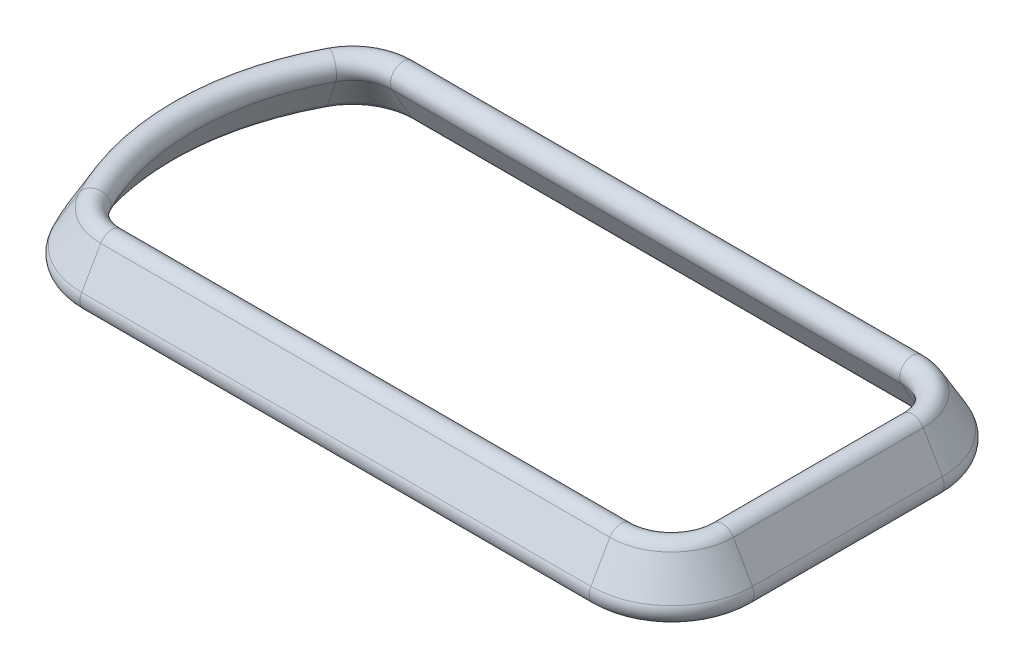
ISO-10303-21;
HEADER;
FILE_DESCRIPTION(('STEP AP214'),'2;1');
FILE_NAME('part.step','',(''),(''),'','','');
FILE_SCHEMA(('AUTOMOTIVE_DESIGN { 1 0 10303 214 1 1 1 1 }'));
ENDSEC;
DATA;
#1=APPLICATION_CONTEXT('core data for automotive mechanical design processes');
#2=APPLICATION_PROTOCOL_DEFINITION('international standard','automotive_design',2000,#1);
#3=PRODUCT_CONTEXT('',#1,'mechanical');
#4=PRODUCT('Part','Part','',(#3));
#5=PRODUCT_RELATED_PRODUCT_CATEGORY('part','',(#4));
#6=PRODUCT_DEFINITION_FORMATION('','',#4);
#7=PRODUCT_DEFINITION_CONTEXT('part definition',#1,'design');
#8=PRODUCT_DEFINITION('design','',#6,#7);
#9=PRODUCT_DEFINITION_SHAPE('','',#8);
#10=(LENGTH_UNIT() NAMED_UNIT(*) SI_UNIT(.MILLI.,.METRE.));
#11=(NAMED_UNIT(*) PLANE_ANGLE_UNIT() SI_UNIT($,.RADIAN.));
#12=(NAMED_UNIT(*) SI_UNIT($,.STERADIAN.) SOLID_ANGLE_UNIT());
#13=UNCERTAINTY_MEASURE_WITH_UNIT(LENGTH_MEASURE(1.E-05),#10,'distance_accuracy_value','');
#14=(GEOMETRIC_REPRESENTATION_CONTEXT(3) GLOBAL_UNCERTAINTY_ASSIGNED_CONTEXT((#13)) GLOBAL_UNIT_ASSIGNED_CONTEXT((#10,
#11,#12)) REPRESENTATION_CONTEXT('',''));
#15=CARTESIAN_POINT('',(0.,0.,0.));
#16=DIRECTION('',(0.,0.,1.));
#17=DIRECTION('',(1.,0.,0.));
#18=AXIS2_PLACEMENT_3D('',#15,#16,#17);
#19=CARTESIAN_POINT('',(-100.351041830044,2.50000000000002,-37.4328113574438));
#20=DIRECTION('',(0.,-1.,0.));
#21=DIRECTION('',(0.,0.,-1.));
#22=AXIS2_PLACEMENT_3D('',#19,#20,#21);
#23=CONICAL_SURFACE('',#22,24.3301270189222,0.523598775598298);
#24=DIRECTION('',(0.,-0.866025403784437,-0.500000000000002));
#25=VECTOR('',#24,1.);
#26=CARTESIAN_POINT('',(-100.351041830044,2.50000000000002,-61.762938376366));
#27=LINE('',#26,#25);
#28=CARTESIAN_POINT('',(-100.351041830044,2.50000000000002,-61.762938376366));
#29=VERTEX_POINT('',#28);
#30=CARTESIAN_POINT('',(-100.351041830044,-10.4903810567666,-69.262938376366));
#31=VERTEX_POINT('',#30);
#32=EDGE_CURVE('E308',#29,#31,#27,.T.);
#33=ORIENTED_EDGE('',*,*,#32,.T.);
#34=CARTESIAN_POINT('',(-100.351041830044,-10.4903810567666,-37.4328113574438));
#35=DIRECTION('',(0.,1.,0.));
#36=DIRECTION('',(0.,0.,1.));
#37=AXIS2_PLACEMENT_3D('',#34,#35,#36);
#38=CIRCLE('',#37,31.8301270189221);
#39=CARTESIAN_POINT('',(-128.481745622582,-10.4903810567666,-52.3264506097287));
#40=VERTEX_POINT('',#39);
#41=EDGE_CURVE('E45',#31,#40,#38,.T.);
#42=ORIENTED_EDGE('',*,*,#41,.T.);
#43=DIRECTION('',(-0.441888022875549,-0.866025403784437,-0.233955070984025));
#44=VECTOR('',#43,1.);
#45=CARTESIAN_POINT('',(-121.853425279449,2.50000000000002,-48.8171245449683));
#46=LINE('',#45,#44);
#47=CARTESIAN_POINT('',(-121.853425279449,2.50000000000002,-48.8171245449683));
#48=VERTEX_POINT('',#47);
#49=EDGE_CURVE('E332',#48,#40,#46,.T.);
#50=ORIENTED_EDGE('',*,*,#49,.F.);
#51=CARTESIAN_POINT('',(-100.351041830044,2.50000000000002,-37.4328113574438));
#52=DIRECTION('',(0.,1.,0.));
#53=DIRECTION('',(0.,0.,1.));
#54=AXIS2_PLACEMENT_3D('',#51,#52,#53);
#55=CIRCLE('',#54,24.3301270189222);
#56=EDGE_CURVE('E11',#29,#48,#55,.T.);
#57=ORIENTED_EDGE('',*,*,#56,.F.);
#58=EDGE_LOOP('',(#33,#42,#50,#57));
#59=FACE_BOUND('',#58,.T.);
#60=ADVANCED_FACE('F37',(#59),#23,.T.);
#61=CARTESIAN_POINT('',(-100.351041830044,-12.9903810567666,-37.4328113574438));
#62=DIRECTION('',(0.,1.,0.));
#63=DIRECTION('',(0.,0.,1.));
#64=AXIS2_PLACEMENT_3D('',#61,#62,#63);
#65=TOROIDAL_SURFACE('',#64,27.5,4.99999999999997);
#66=CARTESIAN_POINT('',(-100.351041830044,-12.9903810567666,-64.9328113574438));
#67=DIRECTION('',(-1.,0.,0.));
#68=DIRECTION('',(0.,0.,1.));
#69=AXIS2_PLACEMENT_3D('',#66,#67,#68);
#70=CIRCLE('',#69,4.99999999999997);
#71=CARTESIAN_POINT('',(-100.351041830044,-15.4903810567666,-60.6026843385217));
#72=VERTEX_POINT('',#71);
#73=EDGE_CURVE('E305',#31,#72,#70,.T.);
#74=ORIENTED_EDGE('',*,*,#73,.T.);
#75=CARTESIAN_POINT('',(-100.351041830044,-15.4903810567666,-37.4328113574438));
#76=DIRECTION('',(0.,1.,0.));
#77=DIRECTION('',(0.,0.,1.));
#78=AXIS2_PLACEMENT_3D('',#75,#76,#77);
#79=CIRCLE('',#78,23.1698729810779);
#80=CARTESIAN_POINT('',(-120.828020553816,-15.4903810567666,-48.2742299134016));
#81=VERTEX_POINT('',#80);
#82=EDGE_CURVE('E337',#72,#81,#79,.T.);
#83=ORIENTED_EDGE('',*,*,#82,.T.);
#84=CARTESIAN_POINT('',(-124.654883088199,-12.9903810567666,-50.3003402615651));
#85=DIRECTION('',(-0.467910141968048,0.,0.883776045751095));
#86=DIRECTION('',(0.883776045751095,0.,0.467910141968048));
#87=AXIS2_PLACEMENT_3D('',#84,#85,#86);
#88=CIRCLE('',#87,4.99999999999997);
#89=EDGE_CURVE('E330',#40,#81,#88,.T.);
#90=ORIENTED_EDGE('',*,*,#89,.F.);
#91=ORIENTED_EDGE('',*,*,#41,.F.);
#92=EDGE_LOOP('',(#74,#83,#90,#91));
#93=FACE_BOUND('',#92,.T.);
#94=ADVANCED_FACE('F361',(#93),#65,.T.);
#95=CARTESIAN_POINT('',(-100.351041830044,-15.4903810567666,-37.4328113574438));
#96=DIRECTION('',(0.,-1.,0.));
#97=DIRECTION('',(0.,0.,-1.));
#98=AXIS2_PLACEMENT_3D('',#95,#96,#97);
#99=CONICAL_SURFACE('',#98,23.1698729810779,0.523598775598306);
#100=DIRECTION('',(0.,0.866025403784435,0.500000000000006));
#101=VECTOR('',#100,1.);
#102=CARTESIAN_POINT('',(-100.351041830044,-2.50000000000003,-53.1026843385216));
#103=LINE('',#102,#101);
#104=CARTESIAN_POINT('',(-100.351041830044,-2.50000000000003,-53.1026843385216));
#105=VERTEX_POINT('',#104);
#106=EDGE_CURVE('E302',#72,#105,#103,.T.);
#107=ORIENTED_EDGE('',*,*,#106,.T.);
#108=CARTESIAN_POINT('',(-100.351041830044,-2.50000000000003,-37.4328113574438));
#109=DIRECTION('',(0.,1.,0.));
#110=DIRECTION('',(0.,0.,1.));
#111=AXIS2_PLACEMENT_3D('',#108,#109,#110);
#112=CIRCLE('',#111,15.6698729810778);
#113=CARTESIAN_POINT('',(-114.199700210683,-2.50000000000003,-44.7649038486412));
#114=VERTEX_POINT('',#113);
#115=EDGE_CURVE('E334',#105,#114,#112,.T.);
#116=ORIENTED_EDGE('',*,*,#115,.T.);
#117=DIRECTION('',(0.441888022875553,0.866025403784435,0.233955070984027));
#118=VECTOR('',#117,1.);
#119=CARTESIAN_POINT('',(-114.199700210683,-2.50000000000003,-44.7649038486412));
#120=LINE('',#119,#118);
#121=EDGE_CURVE('E327',#81,#114,#120,.T.);
#122=ORIENTED_EDGE('',*,*,#121,.F.);
#123=ORIENTED_EDGE('',*,*,#82,.F.);
#124=EDGE_LOOP('',(#107,#116,#122,#123));
#125=FACE_BOUND('',#124,.T.);
#126=ADVANCED_FACE('F360',(#125),#99,.F.);
#127=CARTESIAN_POINT('',(-100.351041830044,0.,-37.4328113574438));
#128=DIRECTION('',(0.,1.,0.));
#129=DIRECTION('',(0.,0.,1.));
#130=AXIS2_PLACEMENT_3D('',#127,#128,#129);
#131=TOROIDAL_SURFACE('',#130,20.,5.00000000000001);
#132=CARTESIAN_POINT('',(-100.351041830044,0.,-57.4328113574438));
#133=DIRECTION('',(-1.,0.,0.));
#134=DIRECTION('',(0.,0.,1.));
#135=AXIS2_PLACEMENT_3D('',#132,#133,#134);
#136=CIRCLE('',#135,5.00000000000001);
#137=EDGE_CURVE('E299',#105,#29,#136,.T.);
#138=ORIENTED_EDGE('',*,*,#137,.T.);
#139=ORIENTED_EDGE('',*,*,#56,.T.);
#140=CARTESIAN_POINT('',(-118.026562745066,0.,-46.7910141968047));
#141=DIRECTION('',(-0.467910141968048,0.,0.883776045751095));
#142=DIRECTION('',(0.883776045751095,0.,0.467910141968048));
#143=AXIS2_PLACEMENT_3D('',#140,#141,#142);
#144=CIRCLE('',#143,5.00000000000001);
#145=EDGE_CURVE('E177',#114,#48,#144,.T.);
#146=ORIENTED_EDGE('',*,*,#145,.F.);
#147=ORIENTED_EDGE('',*,*,#115,.F.);
#148=EDGE_LOOP('',(#138,#139,#146,#147));
#149=FACE_BOUND('',#148,.T.);
#150=ADVANCED_FACE('F484',(#149),#131,.T.);
#151=CARTESIAN_POINT('',(100.351041830044,2.50000000000002,-61.762938376366));
#152=DIRECTION('',(0.,0.500000000000002,-0.866025403784437));
#153=DIRECTION('',(0.,0.866025403784438,0.500000000000002));
#154=AXIS2_PLACEMENT_3D('',#151,#152,#153);
#155=PLANE('',#154);
#156=DIRECTION('',(0.,-0.866025403784437,-0.500000000000002));
#157=VECTOR('',#156,1.);
#158=CARTESIAN_POINT('',(100.351041830044,2.50000000000002,-61.762938376366));
#159=LINE('',#158,#157);
#160=CARTESIAN_POINT('',(100.351041830044,2.50000000000002,-61.762938376366));
#161=VERTEX_POINT('',#160);
#162=CARTESIAN_POINT('',(100.351041830044,-10.4903810567666,-69.262938376366));
#163=VERTEX_POINT('',#162);
#164=EDGE_CURVE('E284',#161,#163,#159,.T.);
#165=ORIENTED_EDGE('',*,*,#164,.T.);
#166=DIRECTION('',(-1.,0.,0.));
#167=VECTOR('',#166,1.);
#168=CARTESIAN_POINT('',(100.351041830044,-10.4903810567666,-69.262938376366));
#169=LINE('',#168,#167);
#170=EDGE_CURVE('E319',#163,#31,#169,.T.);
#171=ORIENTED_EDGE('',*,*,#170,.T.);
#172=ORIENTED_EDGE('',*,*,#32,.F.);
#173=DIRECTION('',(-1.,0.,0.));
#174=VECTOR('',#173,1.);
#175=CARTESIAN_POINT('',(100.351041830044,2.50000000000002,-61.762938376366));
#176=LINE('',#175,#174);
#177=EDGE_CURVE('E323',#161,#29,#176,.T.);
#178=ORIENTED_EDGE('',*,*,#177,.F.);
#179=EDGE_LOOP('',(#165,#171,#172,#178));
#180=FACE_BOUND('',#179,.T.);
#181=ADVANCED_FACE('F419',(#180),#155,.T.);
#182=CARTESIAN_POINT('',(100.351041830044,-12.9903810567666,-64.9328113574438));
#183=DIRECTION('',(-1.,0.,0.));
#184=DIRECTION('',(0.,0.,1.));
#185=AXIS2_PLACEMENT_3D('',#182,#183,#184);
#186=CYLINDRICAL_SURFACE('',#185,4.99999999999997);
#187=CARTESIAN_POINT('',(100.351041830044,-12.9903810567666,-64.9328113574438));
#188=DIRECTION('',(-1.,0.,0.));
#189=DIRECTION('',(0.,0.,1.));
#190=AXIS2_PLACEMENT_3D('',#187,#188,#189);
#191=CIRCLE('',#190,4.99999999999997);
#192=CARTESIAN_POINT('',(100.351041830044,-15.4903810567666,-60.6026843385217));
#193=VERTEX_POINT('',#192);
#194=EDGE_CURVE('E281',#163,#193,#191,.T.);
#195=ORIENTED_EDGE('',*,*,#194,.T.);
#196=DIRECTION('',(-1.,0.,0.));
#197=VECTOR('',#196,1.);
#198=CARTESIAN_POINT('',(100.351041830044,-15.4903810567666,-60.6026843385217));
#199=LINE('',#198,#197);
#200=EDGE_CURVE('E315',#193,#72,#199,.T.);
#201=ORIENTED_EDGE('',*,*,#200,.T.);
#202=ORIENTED_EDGE('',*,*,#73,.F.);
#203=ORIENTED_EDGE('',*,*,#170,.F.);
#204=EDGE_LOOP('',(#195,#201,#202,#203));
#205=FACE_BOUND('',#204,.T.);
#206=ADVANCED_FACE('F368',(#205),#186,.T.);
#207=CARTESIAN_POINT('',(100.351041830044,-2.50000000000003,-53.1026843385216));
#208=DIRECTION('',(0.,-0.500000000000006,0.866025403784435));
#209=DIRECTION('',(0.,-0.866025403784435,-0.500000000000006));
#210=AXIS2_PLACEMENT_3D('',#207,#208,#209);
#211=PLANE('',#210);
#212=DIRECTION('',(0.,0.866025403784435,0.500000000000006));
#213=VECTOR('',#212,1.);
#214=CARTESIAN_POINT('',(100.351041830044,-2.50000000000003,-53.1026843385216));
#215=LINE('',#214,#213);
#216=CARTESIAN_POINT('',(100.351041830044,-2.50000000000003,-53.1026843385216));
#217=VERTEX_POINT('',#216);
#218=EDGE_CURVE('E278',#193,#217,#215,.T.);
#219=ORIENTED_EDGE('',*,*,#218,.T.);
#220=DIRECTION('',(-1.,0.,0.));
#221=VECTOR('',#220,1.);
#222=CARTESIAN_POINT('',(100.351041830044,-2.50000000000003,-53.1026843385216));
#223=LINE('',#222,#221);
#224=EDGE_CURVE('E311',#217,#105,#223,.T.);
#225=ORIENTED_EDGE('',*,*,#224,.T.);
#226=ORIENTED_EDGE('',*,*,#106,.F.);
#227=ORIENTED_EDGE('',*,*,#200,.F.);
#228=EDGE_LOOP('',(#219,#225,#226,#227));
#229=FACE_BOUND('',#228,.T.);
#230=ADVANCED_FACE('F366',(#229),#211,.T.);
#231=CARTESIAN_POINT('',(100.351041830044,0.,-57.4328113574438));
#232=DIRECTION('',(-1.,0.,0.));
#233=DIRECTION('',(0.,0.,1.));
#234=AXIS2_PLACEMENT_3D('',#231,#232,#233);
#235=CYLINDRICAL_SURFACE('',#234,5.00000000000001);
#236=CARTESIAN_POINT('',(100.351041830044,0.,-57.4328113574438));
#237=DIRECTION('',(-1.,0.,0.));
#238=DIRECTION('',(0.,0.,1.));
#239=AXIS2_PLACEMENT_3D('',#236,#237,#238);
#240=CIRCLE('',#239,5.00000000000001);
#241=EDGE_CURVE('E275',#217,#161,#240,.T.);
#242=ORIENTED_EDGE('',*,*,#241,.T.);
#243=ORIENTED_EDGE('',*,*,#177,.T.);
#244=ORIENTED_EDGE('',*,*,#137,.F.);
#245=ORIENTED_EDGE('',*,*,#224,.F.);
#246=EDGE_LOOP('',(#242,#243,#244,#245));
#247=FACE_BOUND('',#246,.T.);
#248=ADVANCED_FACE('F421',(#247),#235,.T.);
#249=CARTESIAN_POINT('',(100.351041830044,2.50000000000002,-37.4328113574438));
#250=DIRECTION('',(0.,-1.,0.));
#251=DIRECTION('',(0.,0.,-1.));
#252=AXIS2_PLACEMENT_3D('',#249,#250,#251);
#253=CONICAL_SURFACE('',#252,24.3301270189222,0.523598775598299);
#254=DIRECTION('',(0.500000000000002,-0.866025403784437,0.));
#255=VECTOR('',#254,1.);
#256=CARTESIAN_POINT('',(124.681168848966,2.50000000000002,-37.4328113574438));
#257=LINE('',#256,#255);
#258=CARTESIAN_POINT('',(124.681168848966,2.50000000000002,-37.4328113574438));
#259=VERTEX_POINT('',#258);
#260=CARTESIAN_POINT('',(132.181168848966,-10.4903810567666,-37.4328113574438));
#261=VERTEX_POINT('',#260);
#262=EDGE_CURVE('E260',#259,#261,#257,.T.);
#263=ORIENTED_EDGE('',*,*,#262,.T.);
#264=CARTESIAN_POINT('',(100.351041830044,-10.4903810567666,-37.4328113574438));
#265=DIRECTION('',(0.,1.,0.));
#266=DIRECTION('',(0.,0.,1.));
#267=AXIS2_PLACEMENT_3D('',#264,#265,#266);
#268=CIRCLE('',#267,31.8301270189222);
#269=EDGE_CURVE('E293',#261,#163,#268,.T.);
#270=ORIENTED_EDGE('',*,*,#269,.T.);
#271=ORIENTED_EDGE('',*,*,#164,.F.);
#272=CARTESIAN_POINT('',(100.351041830044,2.50000000000002,-37.4328113574438));
#273=DIRECTION('',(0.,1.,0.));
#274=DIRECTION('',(0.,0.,1.));
#275=AXIS2_PLACEMENT_3D('',#272,#273,#274);
#276=CIRCLE('',#275,24.3301270189222);
#277=EDGE_CURVE('E296',#259,#161,#276,.T.);
#278=ORIENTED_EDGE('',*,*,#277,.F.);
#279=EDGE_LOOP('',(#263,#270,#271,#278));
#280=FACE_BOUND('',#279,.T.);
#281=ADVANCED_FACE('F425',(#280),#253,.T.);
#282=CARTESIAN_POINT('',(100.351041830044,-12.9903810567666,-37.4328113574438));
#283=DIRECTION('',(0.,1.,0.));
#284=DIRECTION('',(0.,0.,1.));
#285=AXIS2_PLACEMENT_3D('',#282,#283,#284);
#286=TOROIDAL_SURFACE('',#285,27.5,4.99999999999997);
#287=CARTESIAN_POINT('',(127.851041830044,-12.9903810567666,-37.4328113574438));
#288=DIRECTION('',(0.,0.,-1.));
#289=DIRECTION('',(-1.,0.,0.));
#290=AXIS2_PLACEMENT_3D('',#287,#288,#289);
#291=CIRCLE('',#290,4.99999999999997);
#292=CARTESIAN_POINT('',(123.520914811122,-15.4903810567666,-37.4328113574438));
#293=VERTEX_POINT('',#292);
#294=EDGE_CURVE('E257',#261,#293,#291,.T.);
#295=ORIENTED_EDGE('',*,*,#294,.T.);
#296=CARTESIAN_POINT('',(100.351041830044,-15.4903810567666,-37.4328113574438));
#297=DIRECTION('',(0.,1.,0.));
#298=DIRECTION('',(0.,0.,1.));
#299=AXIS2_PLACEMENT_3D('',#296,#297,#298);
#300=CIRCLE('',#299,23.1698729810779);
#301=EDGE_CURVE('E290',#293,#193,#300,.T.);
#302=ORIENTED_EDGE('',*,*,#301,.T.);
#303=ORIENTED_EDGE('',*,*,#194,.F.);
#304=ORIENTED_EDGE('',*,*,#269,.F.);
#305=EDGE_LOOP('',(#295,#302,#303,#304));
#306=FACE_BOUND('',#305,.T.);
#307=ADVANCED_FACE('F375',(#306),#286,.T.);
#308=CARTESIAN_POINT('',(100.351041830044,-15.4903810567666,-37.4328113574438));
#309=DIRECTION('',(0.,-1.,0.));
#310=DIRECTION('',(0.,0.,-1.));
#311=AXIS2_PLACEMENT_3D('',#308,#309,#310);
#312=CONICAL_SURFACE('',#311,23.1698729810779,0.523598775598306);
#313=DIRECTION('',(-0.500000000000006,0.866025403784435,0.));
#314=VECTOR('',#313,1.);
#315=CARTESIAN_POINT('',(116.020914811122,-2.50000000000003,-37.4328113574438));
#316=LINE('',#315,#314);
#317=CARTESIAN_POINT('',(116.020914811122,-2.50000000000003,-37.4328113574438));
#318=VERTEX_POINT('',#317);
#319=EDGE_CURVE('E254',#293,#318,#316,.T.);
#320=ORIENTED_EDGE('',*,*,#319,.T.);
#321=CARTESIAN_POINT('',(100.351041830044,-2.50000000000003,-37.4328113574438));
#322=DIRECTION('',(0.,1.,0.));
#323=DIRECTION('',(0.,0.,1.));
#324=AXIS2_PLACEMENT_3D('',#321,#322,#323);
#325=CIRCLE('',#324,15.6698729810778);
#326=EDGE_CURVE('E287',#318,#217,#325,.T.);
#327=ORIENTED_EDGE('',*,*,#326,.T.);
#328=ORIENTED_EDGE('',*,*,#218,.F.);
#329=ORIENTED_EDGE('',*,*,#301,.F.);
#330=EDGE_LOOP('',(#320,#327,#328,#329));
#331=FACE_BOUND('',#330,.T.);
#332=ADVANCED_FACE('F373',(#331),#312,.F.);
#333=CARTESIAN_POINT('',(100.351041830044,0.,-37.4328113574438));
#334=DIRECTION('',(0.,1.,0.));
#335=DIRECTION('',(0.,0.,1.));
#336=AXIS2_PLACEMENT_3D('',#333,#334,#335);
#337=TOROIDAL_SURFACE('',#336,20.,5.00000000000001);
#338=CARTESIAN_POINT('',(120.351041830044,0.,-37.4328113574438));
#339=DIRECTION('',(0.,0.,-1.));
#340=DIRECTION('',(-1.,0.,0.));
#341=AXIS2_PLACEMENT_3D('',#338,#339,#340);
#342=CIRCLE('',#341,5.00000000000001);
#343=EDGE_CURVE('E251',#318,#259,#342,.T.);
#344=ORIENTED_EDGE('',*,*,#343,.T.);
#345=ORIENTED_EDGE('',*,*,#277,.T.);
#346=ORIENTED_EDGE('',*,*,#241,.F.);
#347=ORIENTED_EDGE('',*,*,#326,.F.);
#348=EDGE_LOOP('',(#344,#345,#346,#347));
#349=FACE_BOUND('',#348,.T.);
#350=ADVANCED_FACE('F426',(#349),#337,.T.);
#351=CARTESIAN_POINT('',(124.681168848966,2.50000000000002,37.4328113574438));
#352=DIRECTION('',(0.866025403784437,0.500000000000002,0.));
#353=DIRECTION('',(-0.500000000000002,0.866025403784438,0.));
#354=AXIS2_PLACEMENT_3D('',#351,#352,#353);
#355=PLANE('',#354);
#356=DIRECTION('',(0.500000000000002,-0.866025403784437,0.));
#357=VECTOR('',#356,1.);
#358=CARTESIAN_POINT('',(124.681168848966,2.50000000000002,37.4328113574438));
#359=LINE('',#358,#357);
#360=CARTESIAN_POINT('',(124.681168848966,2.50000000000002,37.4328113574438));
#361=VERTEX_POINT('',#360);
#362=CARTESIAN_POINT('',(132.181168848966,-10.4903810567666,37.4328113574438));
#363=VERTEX_POINT('',#362);
#364=EDGE_CURVE('E236',#361,#363,#359,.T.);
#365=ORIENTED_EDGE('',*,*,#364,.T.);
#366=DIRECTION('',(0.,0.,-1.));
#367=VECTOR('',#366,1.);
#368=CARTESIAN_POINT('',(132.181168848966,-10.4903810567666,37.4328113574438));
#369=LINE('',#368,#367);
#370=EDGE_CURVE('E269',#363,#261,#369,.T.);
#371=ORIENTED_EDGE('',*,*,#370,.T.);
#372=ORIENTED_EDGE('',*,*,#262,.F.);
#373=DIRECTION('',(0.,0.,-1.));
#374=VECTOR('',#373,1.);
#375=CARTESIAN_POINT('',(124.681168848966,2.50000000000002,37.4328113574438));
#376=LINE('',#375,#374);
#377=EDGE_CURVE('E272',#361,#259,#376,.T.);
#378=ORIENTED_EDGE('',*,*,#377,.F.);
#379=EDGE_LOOP('',(#365,#371,#372,#378));
#380=FACE_BOUND('',#379,.T.);
#381=ADVANCED_FACE('F430',(#380),#355,.T.);
#382=CARTESIAN_POINT('',(127.851041830044,-12.9903810567666,37.4328113574438));
#383=DIRECTION('',(0.,0.,-1.));
#384=DIRECTION('',(-1.,0.,0.));
#385=AXIS2_PLACEMENT_3D('',#382,#383,#384);
#386=CYLINDRICAL_SURFACE('',#385,4.99999999999997);
#387=CARTESIAN_POINT('',(127.851041830044,-12.9903810567666,37.4328113574438));
#388=DIRECTION('',(0.,0.,-1.));
#389=DIRECTION('',(-1.,0.,0.));
#390=AXIS2_PLACEMENT_3D('',#387,#388,#389);
#391=CIRCLE('',#390,4.99999999999997);
#392=CARTESIAN_POINT('',(123.520914811122,-15.4903810567666,37.4328113574438));
#393=VERTEX_POINT('',#392);
#394=EDGE_CURVE('E233',#363,#393,#391,.T.);
#395=ORIENTED_EDGE('',*,*,#394,.T.);
#396=DIRECTION('',(0.,0.,-1.));
#397=VECTOR('',#396,1.);
#398=CARTESIAN_POINT('',(123.520914811122,-15.4903810567666,37.4328113574438));
#399=LINE('',#398,#397);
#400=EDGE_CURVE('E266',#393,#293,#399,.T.);
#401=ORIENTED_EDGE('',*,*,#400,.T.);
#402=ORIENTED_EDGE('',*,*,#294,.F.);
#403=ORIENTED_EDGE('',*,*,#370,.F.);
#404=EDGE_LOOP('',(#395,#401,#402,#403));
#405=FACE_BOUND('',#404,.T.);
#406=ADVANCED_FACE('F382',(#405),#386,.T.);
#407=CARTESIAN_POINT('',(116.020914811122,-2.50000000000003,37.4328113574438));
#408=DIRECTION('',(-0.866025403784435,-0.500000000000006,0.));
#409=DIRECTION('',(0.500000000000006,-0.866025403784435,0.));
#410=AXIS2_PLACEMENT_3D('',#407,#408,#409);
#411=PLANE('',#410);
#412=DIRECTION('',(-0.500000000000006,0.866025403784435,0.));
#413=VECTOR('',#412,1.);
#414=CARTESIAN_POINT('',(116.020914811122,-2.50000000000003,37.4328113574438));
#415=LINE('',#414,#413);
#416=CARTESIAN_POINT('',(116.020914811122,-2.50000000000003,37.4328113574438));
#417=VERTEX_POINT('',#416);
#418=EDGE_CURVE('E230',#393,#417,#415,.T.);
#419=ORIENTED_EDGE('',*,*,#418,.T.);
#420=DIRECTION('',(0.,0.,-1.));
#421=VECTOR('',#420,1.);
#422=CARTESIAN_POINT('',(116.020914811122,-2.50000000000003,37.4328113574438));
#423=LINE('',#422,#421);
#424=EDGE_CURVE('E263',#417,#318,#423,.T.);
#425=ORIENTED_EDGE('',*,*,#424,.T.);
#426=ORIENTED_EDGE('',*,*,#319,.F.);
#427=ORIENTED_EDGE('',*,*,#400,.F.);
#428=EDGE_LOOP('',(#419,#425,#426,#427));
#429=FACE_BOUND('',#428,.T.);
#430=ADVANCED_FACE('F380',(#429),#411,.T.);
#431=CARTESIAN_POINT('',(120.351041830044,0.,37.4328113574438));
#432=DIRECTION('',(0.,0.,-1.));
#433=DIRECTION('',(-1.,0.,0.));
#434=AXIS2_PLACEMENT_3D('',#431,#432,#433);
#435=CYLINDRICAL_SURFACE('',#434,5.00000000000001);
#436=CARTESIAN_POINT('',(120.351041830044,0.,37.4328113574438));
#437=DIRECTION('',(0.,0.,-1.));
#438=DIRECTION('',(-1.,0.,0.));
#439=AXIS2_PLACEMENT_3D('',#436,#437,#438);
#440=CIRCLE('',#439,5.00000000000001);
#441=EDGE_CURVE('E227',#417,#361,#440,.T.);
#442=ORIENTED_EDGE('',*,*,#441,.T.);
#443=ORIENTED_EDGE('',*,*,#377,.T.);
#444=ORIENTED_EDGE('',*,*,#343,.F.);
#445=ORIENTED_EDGE('',*,*,#424,.F.);
#446=EDGE_LOOP('',(#442,#443,#444,#445));
#447=FACE_BOUND('',#446,.T.);
#448=ADVANCED_FACE('F431',(#447),#435,.T.);
#449=CARTESIAN_POINT('',(100.351041830044,2.50000000000002,37.4328113574438));
#450=DIRECTION('',(0.,-1.,0.));
#451=DIRECTION('',(0.,0.,-1.));
#452=AXIS2_PLACEMENT_3D('',#449,#450,#451);
#453=CONICAL_SURFACE('',#452,24.3301270189222,0.523598775598299);
#454=DIRECTION('',(0.,-0.866025403784437,0.500000000000002));
#455=VECTOR('',#454,1.);
#456=CARTESIAN_POINT('',(100.351041830044,2.50000000000002,61.762938376366));
#457=LINE('',#456,#455);
#458=CARTESIAN_POINT('',(100.351041830044,2.50000000000002,61.762938376366));
#459=VERTEX_POINT('',#458);
#460=CARTESIAN_POINT('',(100.351041830044,-10.4903810567666,69.262938376366));
#461=VERTEX_POINT('',#460);
#462=EDGE_CURVE('E212',#459,#461,#457,.T.);
#463=ORIENTED_EDGE('',*,*,#462,.T.);
#464=CARTESIAN_POINT('',(100.351041830044,-10.4903810567666,37.4328113574438));
#465=DIRECTION('',(0.,1.,0.));
#466=DIRECTION('',(0.,0.,1.));
#467=AXIS2_PLACEMENT_3D('',#464,#465,#466);
#468=CIRCLE('',#467,31.8301270189222);
#469=EDGE_CURVE('E245',#461,#363,#468,.T.);
#470=ORIENTED_EDGE('',*,*,#469,.T.);
#471=ORIENTED_EDGE('',*,*,#364,.F.);
#472=CARTESIAN_POINT('',(100.351041830044,2.50000000000002,37.4328113574438));
#473=DIRECTION('',(0.,1.,0.));
#474=DIRECTION('',(0.,0.,1.));
#475=AXIS2_PLACEMENT_3D('',#472,#473,#474);
#476=CIRCLE('',#475,24.3301270189222);
#477=EDGE_CURVE('E248',#459,#361,#476,.T.);
#478=ORIENTED_EDGE('',*,*,#477,.F.);
#479=EDGE_LOOP('',(#463,#470,#471,#478));
#480=FACE_BOUND('',#479,.T.);
#481=ADVANCED_FACE('F435',(#480),#453,.T.);
#482=CARTESIAN_POINT('',(100.351041830044,-12.9903810567666,37.4328113574438));
#483=DIRECTION('',(0.,1.,0.));
#484=DIRECTION('',(0.,0.,1.));
#485=AXIS2_PLACEMENT_3D('',#482,#483,#484);
#486=TOROIDAL_SURFACE('',#485,27.5,4.99999999999997);
#487=CARTESIAN_POINT('',(100.351041830044,-12.9903810567666,64.9328113574439));
#488=DIRECTION('',(1.,0.,0.));
#489=DIRECTION('',(0.,0.,-1.));
#490=AXIS2_PLACEMENT_3D('',#487,#488,#489);
#491=CIRCLE('',#490,4.99999999999997);
#492=CARTESIAN_POINT('',(100.351041830044,-15.4903810567666,60.6026843385217));
#493=VERTEX_POINT('',#492);
#494=EDGE_CURVE('E209',#461,#493,#491,.T.);
#495=ORIENTED_EDGE('',*,*,#494,.T.);
#496=CARTESIAN_POINT('',(100.351041830044,-15.4903810567666,37.4328113574438));
#497=DIRECTION('',(0.,1.,0.));
#498=DIRECTION('',(0.,0.,1.));
#499=AXIS2_PLACEMENT_3D('',#496,#497,#498);
#500=CIRCLE('',#499,23.1698729810779);
#501=EDGE_CURVE('E242',#493,#393,#500,.T.);
#502=ORIENTED_EDGE('',*,*,#501,.T.);
#503=ORIENTED_EDGE('',*,*,#394,.F.);
#504=ORIENTED_EDGE('',*,*,#469,.F.);
#505=EDGE_LOOP('',(#495,#502,#503,#504));
#506=FACE_BOUND('',#505,.T.);
#507=ADVANCED_FACE('F389',(#506),#486,.T.);
#508=CARTESIAN_POINT('',(100.351041830044,-15.4903810567666,37.4328113574438));
#509=DIRECTION('',(0.,-1.,0.));
#510=DIRECTION('',(0.,0.,-1.));
#511=AXIS2_PLACEMENT_3D('',#508,#509,#510);
#512=CONICAL_SURFACE('',#511,23.1698729810779,0.523598775598306);
#513=DIRECTION('',(0.,0.866025403784435,-0.500000000000006));
#514=VECTOR('',#513,1.);
#515=CARTESIAN_POINT('',(100.351041830044,-2.50000000000003,53.1026843385216));
#516=LINE('',#515,#514);
#517=CARTESIAN_POINT('',(100.351041830044,-2.50000000000003,53.1026843385216));
#518=VERTEX_POINT('',#517);
#519=EDGE_CURVE('E206',#493,#518,#516,.T.);
#520=ORIENTED_EDGE('',*,*,#519,.T.);
#521=CARTESIAN_POINT('',(100.351041830044,-2.50000000000003,37.4328113574438));
#522=DIRECTION('',(0.,1.,0.));
#523=DIRECTION('',(0.,0.,1.));
#524=AXIS2_PLACEMENT_3D('',#521,#522,#523);
#525=CIRCLE('',#524,15.6698729810778);
#526=EDGE_CURVE('E239',#518,#417,#525,.T.);
#527=ORIENTED_EDGE('',*,*,#526,.T.);
#528=ORIENTED_EDGE('',*,*,#418,.F.);
#529=ORIENTED_EDGE('',*,*,#501,.F.);
#530=EDGE_LOOP('',(#520,#527,#528,#529));
#531=FACE_BOUND('',#530,.T.);
#532=ADVANCED_FACE('F387',(#531),#512,.F.);
#533=CARTESIAN_POINT('',(100.351041830044,0.,37.4328113574438));
#534=DIRECTION('',(0.,1.,0.));
#535=DIRECTION('',(0.,0.,1.));
#536=AXIS2_PLACEMENT_3D('',#533,#534,#535);
#537=TOROIDAL_SURFACE('',#536,20.,5.00000000000001);
#538=CARTESIAN_POINT('',(100.351041830044,0.,57.4328113574438));
#539=DIRECTION('',(1.,0.,0.));
#540=DIRECTION('',(0.,0.,-1.));
#541=AXIS2_PLACEMENT_3D('',#538,#539,#540);
#542=CIRCLE('',#541,5.00000000000001);
#543=EDGE_CURVE('E164',#518,#459,#542,.T.);
#544=ORIENTED_EDGE('',*,*,#543,.T.);
#545=ORIENTED_EDGE('',*,*,#477,.T.);
#546=ORIENTED_EDGE('',*,*,#441,.F.);
#547=ORIENTED_EDGE('',*,*,#526,.F.);
#548=EDGE_LOOP('',(#544,#545,#546,#547));
#549=FACE_BOUND('',#548,.T.);
#550=ADVANCED_FACE('F436',(#549),#537,.T.);
#551=CARTESIAN_POINT('',(-100.351041830044,2.50000000000002,61.762938376366));
#552=DIRECTION('',(0.,0.500000000000002,0.866025403784437));
#553=DIRECTION('',(0.,-0.866025403784438,0.500000000000002));
#554=AXIS2_PLACEMENT_3D('',#551,#552,#553);
#555=PLANE('',#554);
#556=DIRECTION('',(0.,-0.866025403784437,0.500000000000002));
#557=VECTOR('',#556,1.);
#558=CARTESIAN_POINT('',(-100.351041830044,2.50000000000002,61.762938376366));
#559=LINE('',#558,#557);
#560=CARTESIAN_POINT('',(-100.351041830044,2.50000000000002,61.762938376366));
#561=VERTEX_POINT('',#560);
#562=CARTESIAN_POINT('',(-100.351041830044,-10.4903810567666,69.262938376366));
#563=VERTEX_POINT('',#562);
#564=EDGE_CURVE('E161',#561,#563,#559,.T.);
#565=ORIENTED_EDGE('',*,*,#564,.T.);
#566=DIRECTION('',(1.,0.,0.));
#567=VECTOR('',#566,1.);
#568=CARTESIAN_POINT('',(-100.351041830044,-10.4903810567666,69.262938376366));
#569=LINE('',#568,#567);
#570=EDGE_CURVE('E221',#563,#461,#569,.T.);
#571=ORIENTED_EDGE('',*,*,#570,.T.);
#572=ORIENTED_EDGE('',*,*,#462,.F.);
#573=DIRECTION('',(1.,0.,0.));
#574=VECTOR('',#573,1.);
#575=CARTESIAN_POINT('',(-100.351041830044,2.50000000000002,61.762938376366));
#576=LINE('',#575,#574);
#577=EDGE_CURVE('E224',#561,#459,#576,.T.);
#578=ORIENTED_EDGE('',*,*,#577,.F.);
#579=EDGE_LOOP('',(#565,#571,#572,#578));
#580=FACE_BOUND('',#579,.T.);
#581=ADVANCED_FACE('F440',(#580),#555,.T.);
#582=CARTESIAN_POINT('',(-100.351041830044,-12.9903810567666,64.9328113574438));
#583=DIRECTION('',(1.,0.,0.));
#584=DIRECTION('',(0.,0.,-1.));
#585=AXIS2_PLACEMENT_3D('',#582,#583,#584);
#586=CYLINDRICAL_SURFACE('',#585,4.99999999999997);
#587=CARTESIAN_POINT('',(-100.351041830044,-12.9903810567666,64.9328113574438));
#588=DIRECTION('',(1.,0.,0.));
#589=DIRECTION('',(0.,0.,-1.));
#590=AXIS2_PLACEMENT_3D('',#587,#588,#589);
#591=CIRCLE('',#590,4.99999999999997);
#592=CARTESIAN_POINT('',(-100.351041830044,-15.4903810567666,60.6026843385217));
#593=VERTEX_POINT('',#592);
#594=EDGE_CURVE('E195',#563,#593,#591,.T.);
#595=ORIENTED_EDGE('',*,*,#594,.T.);
#596=DIRECTION('',(1.,0.,0.));
#597=VECTOR('',#596,1.);
#598=CARTESIAN_POINT('',(-100.351041830044,-15.4903810567666,60.6026843385217));
#599=LINE('',#598,#597);
#600=EDGE_CURVE('E218',#593,#493,#599,.T.);
#601=ORIENTED_EDGE('',*,*,#600,.T.);
#602=ORIENTED_EDGE('',*,*,#494,.F.);
#603=ORIENTED_EDGE('',*,*,#570,.F.);
#604=EDGE_LOOP('',(#595,#601,#602,#603));
#605=FACE_BOUND('',#604,.T.);
#606=ADVANCED_FACE('F396',(#605),#586,.T.);
#607=CARTESIAN_POINT('',(-100.351041830044,-2.50000000000003,53.1026843385216));
#608=DIRECTION('',(0.,-0.500000000000006,-0.866025403784435));
#609=DIRECTION('',(0.,0.866025403784435,-0.500000000000006));
#610=AXIS2_PLACEMENT_3D('',#607,#608,#609);
#611=PLANE('',#610);
#612=DIRECTION('',(0.,0.866025403784435,-0.500000000000006));
#613=VECTOR('',#612,1.);
#614=CARTESIAN_POINT('',(-100.351041830044,-2.50000000000003,53.1026843385216));
#615=LINE('',#614,#613);
#616=CARTESIAN_POINT('',(-100.351041830044,-2.50000000000003,53.1026843385216));
#617=VERTEX_POINT('',#616);
#618=EDGE_CURVE('E192',#593,#617,#615,.T.);
#619=ORIENTED_EDGE('',*,*,#618,.T.);
#620=DIRECTION('',(1.,0.,0.));
#621=VECTOR('',#620,1.);
#622=CARTESIAN_POINT('',(-100.351041830044,-2.50000000000003,53.1026843385216));
#623=LINE('',#622,#621);
#624=EDGE_CURVE('E215',#617,#518,#623,.T.);
#625=ORIENTED_EDGE('',*,*,#624,.T.);
#626=ORIENTED_EDGE('',*,*,#519,.F.);
#627=ORIENTED_EDGE('',*,*,#600,.F.);
#628=EDGE_LOOP('',(#619,#625,#626,#627));
#629=FACE_BOUND('',#628,.T.);
#630=ADVANCED_FACE('F394',(#629),#611,.T.);
#631=CARTESIAN_POINT('',(-100.351041830044,0.,57.4328113574438));
#632=DIRECTION('',(1.,0.,0.));
#633=DIRECTION('',(0.,0.,-1.));
#634=AXIS2_PLACEMENT_3D('',#631,#632,#633);
#635=CYLINDRICAL_SURFACE('',#634,5.00000000000001);
#636=CARTESIAN_POINT('',(-100.351041830044,0.,57.4328113574438));
#637=DIRECTION('',(1.,0.,0.));
#638=DIRECTION('',(0.,0.,-1.));
#639=AXIS2_PLACEMENT_3D('',#636,#637,#638);
#640=CIRCLE('',#639,5.00000000000001);
#641=EDGE_CURVE('E179',#617,#561,#640,.T.);
#642=ORIENTED_EDGE('',*,*,#641,.T.);
#643=ORIENTED_EDGE('',*,*,#577,.T.);
#644=ORIENTED_EDGE('',*,*,#543,.F.);
#645=ORIENTED_EDGE('',*,*,#624,.F.);
#646=EDGE_LOOP('',(#642,#643,#644,#645));
#647=FACE_BOUND('',#646,.T.);
#648=ADVANCED_FACE('F410',(#647),#635,.T.);
#649=CARTESIAN_POINT('',(-100.351041830044,2.50000000000002,37.4328113574438));
#650=DIRECTION('',(0.,-1.,0.));
#651=DIRECTION('',(0.,0.,-1.));
#652=AXIS2_PLACEMENT_3D('',#649,#650,#651);
#653=CONICAL_SURFACE('',#652,24.3301270189222,0.5235987755983);
#654=DIRECTION('',(-0.441888022875549,-0.866025403784437,0.233955070984025));
#655=VECTOR('',#654,1.);
#656=CARTESIAN_POINT('',(-121.853425279449,2.50000000000002,48.8171245449683));
#657=LINE('',#656,#655);
#658=CARTESIAN_POINT('',(-121.853425279449,2.50000000000002,48.8171245449683));
#659=VERTEX_POINT('',#658);
#660=CARTESIAN_POINT('',(-128.481745622582,-10.4903810567666,52.3264506097287));
#661=VERTEX_POINT('',#660);
#662=EDGE_CURVE('E159',#659,#661,#657,.T.);
#663=ORIENTED_EDGE('',*,*,#662,.T.);
#664=CARTESIAN_POINT('',(-100.351041830044,-10.4903810567666,37.4328113574438));
#665=DIRECTION('',(0.,1.,0.));
#666=DIRECTION('',(0.,0.,1.));
#667=AXIS2_PLACEMENT_3D('',#664,#665,#666);
#668=CIRCLE('',#667,31.8301270189222);
#669=EDGE_CURVE('E165',#661,#563,#668,.T.);
#670=ORIENTED_EDGE('',*,*,#669,.T.);
#671=ORIENTED_EDGE('',*,*,#564,.F.);
#672=CARTESIAN_POINT('',(-100.351041830044,2.50000000000002,37.4328113574438));
#673=DIRECTION('',(0.,1.,0.));
#674=DIRECTION('',(0.,0.,1.));
#675=AXIS2_PLACEMENT_3D('',#672,#673,#674);
#676=CIRCLE('',#675,24.3301270189222);
#677=EDGE_CURVE('E155',#659,#561,#676,.T.);
#678=ORIENTED_EDGE('',*,*,#677,.F.);
#679=EDGE_LOOP('',(#663,#670,#671,#678));
#680=FACE_BOUND('',#679,.T.);
#681=ADVANCED_FACE('F157',(#680),#653,.T.);
#682=CARTESIAN_POINT('',(-100.351041830044,-12.9903810567666,37.4328113574438));
#683=DIRECTION('',(0.,1.,0.));
#684=DIRECTION('',(0.,0.,1.));
#685=AXIS2_PLACEMENT_3D('',#682,#683,#684);
#686=TOROIDAL_SURFACE('',#685,27.5,4.99999999999997);
#687=CARTESIAN_POINT('',(-124.654883088199,-12.9903810567666,50.3003402615651));
#688=DIRECTION('',(0.467910141968047,0.,0.883776045751095));
#689=DIRECTION('',(0.883776045751095,0.,-0.467910141968047));
#690=AXIS2_PLACEMENT_3D('',#687,#688,#689);
#691=CIRCLE('',#690,4.99999999999997);
#692=CARTESIAN_POINT('',(-120.828020553816,-15.4903810567666,48.2742299134016));
#693=VERTEX_POINT('',#692);
#694=EDGE_CURVE('E182',#661,#693,#691,.T.);
#695=ORIENTED_EDGE('',*,*,#694,.T.);
#696=CARTESIAN_POINT('',(-100.351041830044,-15.4903810567666,37.4328113574438));
#697=DIRECTION('',(0.,1.,0.));
#698=DIRECTION('',(0.,0.,1.));
#699=AXIS2_PLACEMENT_3D('',#696,#697,#698);
#700=CIRCLE('',#699,23.1698729810779);
#701=EDGE_CURVE('E200',#693,#593,#700,.T.);
#702=ORIENTED_EDGE('',*,*,#701,.T.);
#703=ORIENTED_EDGE('',*,*,#594,.F.);
#704=ORIENTED_EDGE('',*,*,#669,.F.);
#705=EDGE_LOOP('',(#695,#702,#703,#704));
#706=FACE_BOUND('',#705,.T.);
#707=ADVANCED_FACE('F402',(#706),#686,.T.);
#708=CARTESIAN_POINT('',(-100.351041830044,-15.4903810567666,37.4328113574438));
#709=DIRECTION('',(0.,-1.,0.));
#710=DIRECTION('',(0.,0.,-1.));
#711=AXIS2_PLACEMENT_3D('',#708,#709,#710);
#712=CONICAL_SURFACE('',#711,23.1698729810779,0.523598775598306);
#713=DIRECTION('',(0.441888022875553,0.866025403784435,-0.233955070984027));
#714=VECTOR('',#713,1.);
#715=CARTESIAN_POINT('',(-114.199700210683,-2.50000000000003,44.7649038486412));
#716=LINE('',#715,#714);
#717=CARTESIAN_POINT('',(-114.199700210683,-2.50000000000003,44.7649038486412));
#718=VERTEX_POINT('',#717);
#719=EDGE_CURVE('E185',#693,#718,#716,.T.);
#720=ORIENTED_EDGE('',*,*,#719,.T.);
#721=CARTESIAN_POINT('',(-100.351041830044,-2.50000000000003,37.4328113574438));
#722=DIRECTION('',(0.,1.,0.));
#723=DIRECTION('',(0.,0.,1.));
#724=AXIS2_PLACEMENT_3D('',#721,#722,#723);
#725=CIRCLE('',#724,15.6698729810778);
#726=EDGE_CURVE('E171',#718,#617,#725,.T.);
#727=ORIENTED_EDGE('',*,*,#726,.T.);
#728=ORIENTED_EDGE('',*,*,#618,.F.);
#729=ORIENTED_EDGE('',*,*,#701,.F.);
#730=EDGE_LOOP('',(#720,#727,#728,#729));
#731=FACE_BOUND('',#730,.T.);
#732=ADVANCED_FACE('F401',(#731),#712,.F.);
#733=CARTESIAN_POINT('',(-100.351041830044,0.,37.4328113574438));
#734=DIRECTION('',(0.,1.,0.));
#735=DIRECTION('',(0.,0.,1.));
#736=AXIS2_PLACEMENT_3D('',#733,#734,#735);
#737=TOROIDAL_SURFACE('',#736,20.,5.00000000000001);
#738=CARTESIAN_POINT('',(-118.026562745066,0.,46.7910141968048));
#739=DIRECTION('',(0.467910141968047,0.,0.883776045751095));
#740=DIRECTION('',(0.883776045751095,0.,-0.467910141968047));
#741=AXIS2_PLACEMENT_3D('',#738,#739,#740);
#742=CIRCLE('',#741,5.00000000000001);
#743=EDGE_CURVE('E168',#718,#659,#742,.T.);
#744=ORIENTED_EDGE('',*,*,#743,.T.);
#745=ORIENTED_EDGE('',*,*,#677,.T.);
#746=ORIENTED_EDGE('',*,*,#641,.F.);
#747=ORIENTED_EDGE('',*,*,#726,.F.);
#748=EDGE_LOOP('',(#744,#745,#746,#747));
#749=FACE_BOUND('',#748,.T.);
#750=ADVANCED_FACE('F169',(#749),#737,.T.);
#751=CARTESIAN_POINT('',(-29.6489581699562,0.,0.));
#752=DIRECTION('',(0.,-1.,0.));
#753=DIRECTION('',(0.,0.,-1.));
#754=AXIS2_PLACEMENT_3D('',#751,#752,#753);
#755=TOROIDAL_SURFACE('',#754,100.,5.00000000000001);
#756=CARTESIAN_POINT('',(-29.6489581699562,2.50000000000002,0.));
#757=DIRECTION('',(0.,-1.,0.));
#758=DIRECTION('',(0.,0.,-1.));
#759=AXIS2_PLACEMENT_3D('',#756,#757,#758);
#760=CIRCLE('',#759,104.330127018922);
#761=EDGE_CURVE('E53',#659,#48,#760,.T.);
#762=ORIENTED_EDGE('',*,*,#761,.F.);
#763=ORIENTED_EDGE('',*,*,#743,.F.);
#764=CARTESIAN_POINT('',(-29.6489581699562,-2.50000000000003,0.));
#765=DIRECTION('',(0.,-1.,0.));
#766=DIRECTION('',(0.,0.,-1.));
#767=AXIS2_PLACEMENT_3D('',#764,#765,#766);
#768=CIRCLE('',#767,95.6698729810778);
#769=EDGE_CURVE('E189',#718,#114,#768,.T.);
#770=ORIENTED_EDGE('',*,*,#769,.T.);
#771=ORIENTED_EDGE('',*,*,#145,.T.);
#772=EDGE_LOOP('',(#762,#763,#770,#771));
#773=FACE_BOUND('',#772,.T.);
#774=ADVANCED_FACE('F175',(#773),#755,.T.);
#775=CARTESIAN_POINT('',(-29.6489581699562,2.50000000000002,0.));
#776=DIRECTION('',(0.,-1.,0.));
#777=DIRECTION('',(0.,0.,-1.));
#778=AXIS2_PLACEMENT_3D('',#775,#776,#777);
#779=CONICAL_SURFACE('',#778,104.330127018922,0.523598775598299);
#780=CARTESIAN_POINT('',(-29.6489581699562,-10.4903810567666,0.));
#781=DIRECTION('',(0.,-1.,0.));
#782=DIRECTION('',(0.,0.,-1.));
#783=AXIS2_PLACEMENT_3D('',#780,#781,#782);
#784=CIRCLE('',#783,111.830127018922);
#785=EDGE_CURVE('E61',#661,#40,#784,.T.);
#786=ORIENTED_EDGE('',*,*,#785,.F.);
#787=ORIENTED_EDGE('',*,*,#662,.F.);
#788=ORIENTED_EDGE('',*,*,#761,.T.);
#789=ORIENTED_EDGE('',*,*,#49,.T.);
#790=EDGE_LOOP('',(#786,#787,#788,#789));
#791=FACE_BOUND('',#790,.T.);
#792=ADVANCED_FACE('F181',(#791),#779,.T.);
#793=CARTESIAN_POINT('',(-29.6489581699562,-12.9903810567666,0.));
#794=DIRECTION('',(0.,-1.,0.));
#795=DIRECTION('',(0.,0.,-1.));
#796=AXIS2_PLACEMENT_3D('',#793,#794,#795);
#797=TOROIDAL_SURFACE('',#796,107.5,4.99999999999997);
#798=CARTESIAN_POINT('',(-29.6489581699562,-15.4903810567666,0.));
#799=DIRECTION('',(0.,-1.,0.));
#800=DIRECTION('',(0.,0.,-1.));
#801=AXIS2_PLACEMENT_3D('',#798,#799,#800);
#802=CIRCLE('',#801,103.169872981078);
#803=EDGE_CURVE('E345',#693,#81,#802,.T.);
#804=ORIENTED_EDGE('',*,*,#803,.F.);
#805=ORIENTED_EDGE('',*,*,#694,.F.);
#806=ORIENTED_EDGE('',*,*,#785,.T.);
#807=ORIENTED_EDGE('',*,*,#89,.T.);
#808=EDGE_LOOP('',(#804,#805,#806,#807));
#809=FACE_BOUND('',#808,.T.);
#810=ADVANCED_FACE('F357',(#809),#797,.T.);
#811=CARTESIAN_POINT('',(-29.6489581699562,-15.4903810567666,0.));
#812=DIRECTION('',(0.,-1.,0.));
#813=DIRECTION('',(0.,0.,-1.));
#814=AXIS2_PLACEMENT_3D('',#811,#812,#813);
#815=CONICAL_SURFACE('',#814,103.169872981078,0.523598775598306);
#816=ORIENTED_EDGE('',*,*,#719,.F.);
#817=ORIENTED_EDGE('',*,*,#803,.T.);
#818=ORIENTED_EDGE('',*,*,#121,.T.);
#819=ORIENTED_EDGE('',*,*,#769,.F.);
#820=EDGE_LOOP('',(#816,#817,#818,#819));
#821=FACE_BOUND('',#820,.T.);
#822=ADVANCED_FACE('F353',(#821),#815,.F.);
#823=CLOSED_SHELL('',(#60,#94,#126,#150,#181,#206,#230,#248,#281,#307,#332,#350,#381,#406,#430,
#448,#481,#507,#532,#550,#581,#606,#630,#648,#681,#707,#732,#750,#774,#792,#810,#822));
#824=MANIFOLD_SOLID_BREP('B2',#823);
#825=ADVANCED_BREP_SHAPE_REPRESENTATION('',(#18,#824),#14);
#826=SHAPE_DEFINITION_REPRESENTATION(#9,#825);
ENDSEC;
END-ISO-10303-21;
